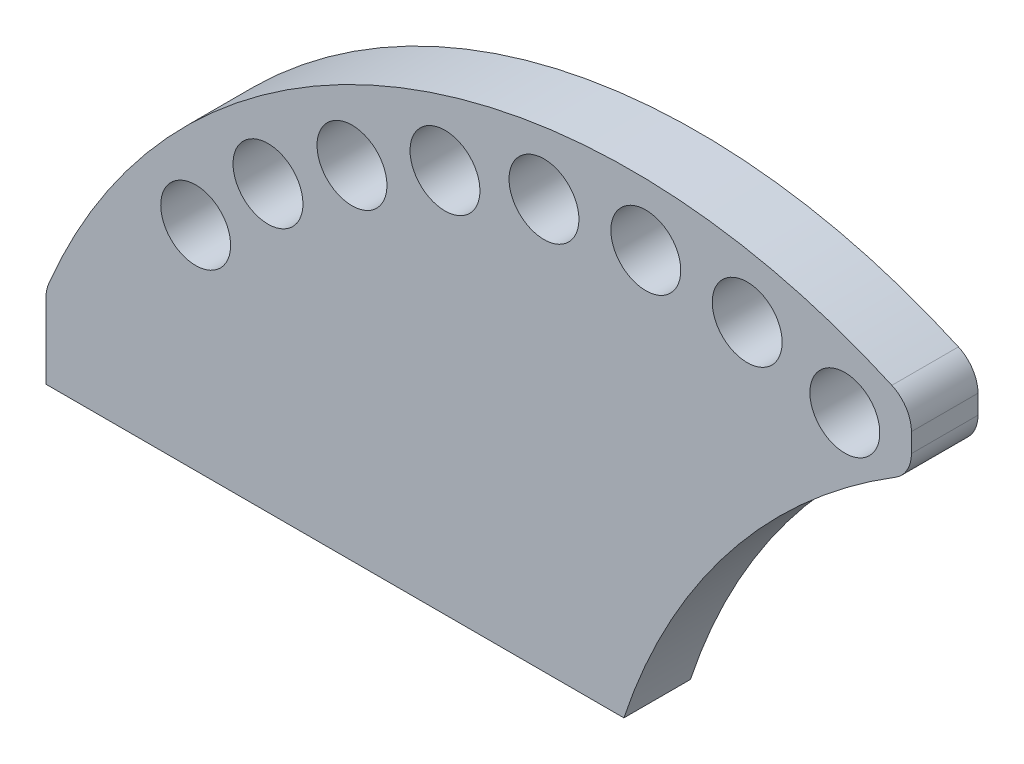
ISO-10303-21;
HEADER;
FILE_DESCRIPTION(('STEP AP214'),'2;1');
FILE_NAME('part.step','',(''),(''),'','','');
FILE_SCHEMA(('AUTOMOTIVE_DESIGN { 1 0 10303 214 1 1 1 1 }'));
ENDSEC;
DATA;
#1=APPLICATION_CONTEXT('core data for automotive mechanical design processes');
#2=APPLICATION_PROTOCOL_DEFINITION('international standard','automotive_design',2000,#1);
#3=PRODUCT_CONTEXT('',#1,'mechanical');
#4=PRODUCT('Part','Part','',(#3));
#5=PRODUCT_RELATED_PRODUCT_CATEGORY('part','',(#4));
#6=PRODUCT_DEFINITION_FORMATION('','',#4);
#7=PRODUCT_DEFINITION_CONTEXT('part definition',#1,'design');
#8=PRODUCT_DEFINITION('design','',#6,#7);
#9=PRODUCT_DEFINITION_SHAPE('','',#8);
#10=(LENGTH_UNIT() NAMED_UNIT(*) SI_UNIT(.MILLI.,.METRE.));
#11=(NAMED_UNIT(*) PLANE_ANGLE_UNIT() SI_UNIT($,.RADIAN.));
#12=(NAMED_UNIT(*) SI_UNIT($,.STERADIAN.) SOLID_ANGLE_UNIT());
#13=UNCERTAINTY_MEASURE_WITH_UNIT(LENGTH_MEASURE(1.E-05),#10,'distance_accuracy_value','');
#14=(GEOMETRIC_REPRESENTATION_CONTEXT(3) GLOBAL_UNCERTAINTY_ASSIGNED_CONTEXT((#13)) GLOBAL_UNIT_ASSIGNED_CONTEXT((#10,
#11,#12)) REPRESENTATION_CONTEXT('',''));
#15=CARTESIAN_POINT('',(0.,0.,0.));
#16=DIRECTION('',(0.,0.,1.));
#17=DIRECTION('',(1.,0.,0.));
#18=AXIS2_PLACEMENT_3D('',#15,#16,#17);
#19=CARTESIAN_POINT('',(-63.,0.,10.));
#20=DIRECTION('',(1.,0.,0.));
#21=DIRECTION('',(0.,1.,0.));
#22=AXIS2_PLACEMENT_3D('',#19,#20,#21);
#23=PLANE('',#22);
#24=DIRECTION('',(0.,-1.,0.));
#25=VECTOR('',#24,1.);
#26=CARTESIAN_POINT('',(-63.,0.,10.));
#27=LINE('',#26,#25);
#28=CARTESIAN_POINT('',(-63.,11.3059270405027,10.));
#29=VERTEX_POINT('',#28);
#30=CARTESIAN_POINT('',(-63.,0.,10.));
#31=VERTEX_POINT('',#30);
#32=EDGE_CURVE('E123',#29,#31,#27,.T.);
#33=ORIENTED_EDGE('',*,*,#32,.F.);
#34=DIRECTION('',(0.,0.,-1.));
#35=VECTOR('',#34,1.);
#36=CARTESIAN_POINT('',(-63.,11.3059270405027,10.));
#37=LINE('',#36,#35);
#38=CARTESIAN_POINT('',(-63.,11.3059270405027,0.));
#39=VERTEX_POINT('',#38);
#40=EDGE_CURVE('E143',#29,#39,#37,.T.);
#41=ORIENTED_EDGE('',*,*,#40,.T.);
#42=DIRECTION('',(0.,-1.,0.));
#43=VECTOR('',#42,1.);
#44=CARTESIAN_POINT('',(-63.,0.,0.));
#45=LINE('',#44,#43);
#46=CARTESIAN_POINT('',(-63.,0.,0.));
#47=VERTEX_POINT('',#46);
#48=EDGE_CURVE('E134',#39,#47,#45,.T.);
#49=ORIENTED_EDGE('',*,*,#48,.T.);
#50=DIRECTION('',(0.,0.,-1.));
#51=VECTOR('',#50,1.);
#52=CARTESIAN_POINT('',(-63.,0.,10.));
#53=LINE('',#52,#51);
#54=EDGE_CURVE('E133',#31,#47,#53,.T.);
#55=ORIENTED_EDGE('',*,*,#54,.F.);
#56=EDGE_LOOP('',(#33,#41,#49,#55));
#57=FACE_BOUND('',#56,.T.);
#58=ADVANCED_FACE('F34',(#57),#23,.F.);
#59=CARTESIAN_POINT('',(-63.,0.,10.));
#60=DIRECTION('',(0.,1.,0.));
#61=DIRECTION('',(0.,0.,1.));
#62=AXIS2_PLACEMENT_3D('',#59,#60,#61);
#63=PLANE('',#62);
#64=DIRECTION('',(1.,0.,0.));
#65=VECTOR('',#64,1.);
#66=CARTESIAN_POINT('',(-63.,0.,0.));
#67=LINE('',#66,#65);
#68=CARTESIAN_POINT('',(23.807895078576,0.,0.));
#69=VERTEX_POINT('',#68);
#70=EDGE_CURVE('E116',#47,#69,#67,.T.);
#71=ORIENTED_EDGE('',*,*,#70,.T.);
#72=DIRECTION('',(0.,0.,-1.));
#73=VECTOR('',#72,1.);
#74=CARTESIAN_POINT('',(23.807895078576,0.,10.));
#75=LINE('',#74,#73);
#76=CARTESIAN_POINT('',(23.807895078576,0.,10.));
#77=VERTEX_POINT('',#76);
#78=EDGE_CURVE('E102',#69,#77,#75,.F.);
#79=ORIENTED_EDGE('',*,*,#78,.T.);
#80=DIRECTION('',(1.,0.,0.));
#81=VECTOR('',#80,1.);
#82=CARTESIAN_POINT('',(-63.,0.,10.));
#83=LINE('',#82,#81);
#84=EDGE_CURVE('E113',#31,#77,#83,.T.);
#85=ORIENTED_EDGE('',*,*,#84,.F.);
#86=ORIENTED_EDGE('',*,*,#54,.T.);
#87=EDGE_LOOP('',(#71,#79,#85,#86));
#88=FACE_BOUND('',#87,.T.);
#89=ADVANCED_FACE('F111',(#88),#63,.F.);
#90=CARTESIAN_POINT('',(67.,0.,10.));
#91=DIRECTION('',(-1.,0.,0.));
#92=DIRECTION('',(0.,0.,1.));
#93=AXIS2_PLACEMENT_3D('',#90,#91,#92);
#94=PLANE('',#93);
#95=DIRECTION('',(0.,1.,0.));
#96=VECTOR('',#95,1.);
#97=CARTESIAN_POINT('',(67.,0.,10.));
#98=LINE('',#97,#96);
#99=CARTESIAN_POINT('',(67.,55.9767410408187,10.));
#100=VERTEX_POINT('',#99);
#101=CARTESIAN_POINT('',(67.,58.8345686742974,10.));
#102=VERTEX_POINT('',#101);
#103=EDGE_CURVE('E124',#100,#102,#98,.T.);
#104=ORIENTED_EDGE('',*,*,#103,.F.);
#105=DIRECTION('',(0.,0.,-1.));
#106=VECTOR('',#105,1.);
#107=CARTESIAN_POINT('',(67.,55.9767410408187,10.));
#108=LINE('',#107,#106);
#109=CARTESIAN_POINT('',(67.,55.9767410408187,0.));
#110=VERTEX_POINT('',#109);
#111=EDGE_CURVE('E42',#100,#110,#108,.T.);
#112=ORIENTED_EDGE('',*,*,#111,.T.);
#113=DIRECTION('',(0.,1.,0.));
#114=VECTOR('',#113,1.);
#115=CARTESIAN_POINT('',(67.,0.,0.));
#116=LINE('',#115,#114);
#117=CARTESIAN_POINT('',(67.,58.8345686742974,0.));
#118=VERTEX_POINT('',#117);
#119=EDGE_CURVE('E138',#110,#118,#116,.T.);
#120=ORIENTED_EDGE('',*,*,#119,.T.);
#121=DIRECTION('',(0.,0.,-1.));
#122=VECTOR('',#121,1.);
#123=CARTESIAN_POINT('',(67.,58.8345686742974,10.));
#124=LINE('',#123,#122);
#125=EDGE_CURVE('E49',#118,#102,#124,.F.);
#126=ORIENTED_EDGE('',*,*,#125,.T.);
#127=EDGE_LOOP('',(#104,#112,#120,#126));
#128=FACE_BOUND('',#127,.T.);
#129=ADVANCED_FACE('F165',(#128),#94,.F.);
#130=CARTESIAN_POINT('',(25.,-23.,10.));
#131=DIRECTION('',(0.,0.,-1.));
#132=DIRECTION('',(-1.,0.,0.));
#133=AXIS2_PLACEMENT_3D('',#130,#131,#132);
#134=CYLINDRICAL_SURFACE('',#133,94.8103369891701);
#135=CARTESIAN_POINT('',(25.,-23.,0.));
#136=DIRECTION('',(0.,0.,1.));
#137=DIRECTION('',(1.,0.,0.));
#138=AXIS2_PLACEMENT_3D('',#135,#136,#137);
#139=CIRCLE('',#138,94.8103369891701);
#140=CARTESIAN_POINT('',(64.0598965130518,63.3905346921159,0.));
#141=VERTEX_POINT('',#140);
#142=CARTESIAN_POINT('',(-62.6208489346838,13.2158367563876,0.));
#143=VERTEX_POINT('',#142);
#144=EDGE_CURVE('E128',#141,#143,#139,.T.);
#145=ORIENTED_EDGE('',*,*,#144,.T.);
#146=DIRECTION('',(0.,0.,-1.));
#147=VECTOR('',#146,1.);
#148=CARTESIAN_POINT('',(-62.6208489346838,13.2158367563876,10.));
#149=LINE('',#148,#147);
#150=CARTESIAN_POINT('',(-62.6208489346838,13.2158367563876,10.));
#151=VERTEX_POINT('',#150);
#152=EDGE_CURVE('E155',#143,#151,#149,.F.);
#153=ORIENTED_EDGE('',*,*,#152,.T.);
#154=CARTESIAN_POINT('',(25.,-23.,10.));
#155=DIRECTION('',(0.,0.,1.));
#156=DIRECTION('',(1.,0.,0.));
#157=AXIS2_PLACEMENT_3D('',#154,#155,#156);
#158=CIRCLE('',#157,94.8103369891701);
#159=CARTESIAN_POINT('',(64.0598965130518,63.3905346921159,10.));
#160=VERTEX_POINT('',#159);
#161=EDGE_CURVE('E126',#160,#151,#158,.T.);
#162=ORIENTED_EDGE('',*,*,#161,.F.);
#163=DIRECTION('',(0.,0.,-1.));
#164=VECTOR('',#163,1.);
#165=CARTESIAN_POINT('',(64.0598965130518,63.3905346921159,10.));
#166=LINE('',#165,#164);
#167=EDGE_CURVE('E152',#160,#141,#166,.T.);
#168=ORIENTED_EDGE('',*,*,#167,.T.);
#169=EDGE_LOOP('',(#145,#153,#162,#168));
#170=FACE_BOUND('',#169,.T.);
#171=ADVANCED_FACE('F176',(#170),#134,.T.);
#172=CARTESIAN_POINT('',(25.,-23.,10.));
#173=DIRECTION('',(0.,0.,1.));
#174=DIRECTION('',(1.,0.,0.));
#175=AXIS2_PLACEMENT_3D('',#172,#173,#174);
#176=PLANE('',#175);
#177=ORIENTED_EDGE('',*,*,#161,.T.);
#178=CARTESIAN_POINT('',(-58.,11.3059270405027,10.));
#179=DIRECTION('',(0.,0.,1.));
#180=DIRECTION('',(1.,0.,0.));
#181=AXIS2_PLACEMENT_3D('',#178,#179,#180);
#182=CIRCLE('',#181,5.);
#183=EDGE_CURVE('E160',#151,#29,#182,.T.);
#184=ORIENTED_EDGE('',*,*,#183,.T.);
#185=ORIENTED_EDGE('',*,*,#32,.T.);
#186=ORIENTED_EDGE('',*,*,#84,.T.);
#187=CARTESIAN_POINT('',(115.,-30.,10.));
#188=DIRECTION('',(0.,0.,-1.));
#189=DIRECTION('',(-1.,0.,0.));
#190=AXIS2_PLACEMENT_3D('',#187,#188,#189);
#191=CIRCLE('',#190,96.);
#192=CARTESIAN_POINT('',(64.6237623762376,51.7204667318673,10.));
#193=VERTEX_POINT('',#192);
#194=EDGE_CURVE('E98',#77,#193,#191,.T.);
#195=ORIENTED_EDGE('',*,*,#194,.T.);
#196=CARTESIAN_POINT('',(62.,55.9767410408187,10.));
#197=DIRECTION('',(0.,0.,1.));
#198=DIRECTION('',(1.,0.,0.));
#199=AXIS2_PLACEMENT_3D('',#196,#197,#198);
#200=CIRCLE('',#199,5.);
#201=EDGE_CURVE('E56',#193,#100,#200,.T.);
#202=ORIENTED_EDGE('',*,*,#201,.T.);
#203=ORIENTED_EDGE('',*,*,#103,.T.);
#204=CARTESIAN_POINT('',(62.,58.8345686742974,10.));
#205=DIRECTION('',(0.,0.,1.));
#206=DIRECTION('',(1.,0.,0.));
#207=AXIS2_PLACEMENT_3D('',#204,#205,#206);
#208=CIRCLE('',#207,5.);
#209=EDGE_CURVE('E157',#102,#160,#208,.T.);
#210=ORIENTED_EDGE('',*,*,#209,.T.);
#211=EDGE_LOOP('',(#177,#184,#185,#186,#195,#202,#203,#210));
#212=FACE_BOUND('',#211,.T.);
#213=CARTESIAN_POINT('',(42.328707165067,60.7255391621181,10.));
#214=DIRECTION('',(0.,0.,-1.));
#215=DIRECTION('',(-0.98392958859863,-0.178556894798637,0.));
#216=AXIS2_PLACEMENT_3D('',#213,#214,#215);
#217=CIRCLE('',#216,5.25);
#218=CARTESIAN_POINT('',(37.1630768249242,59.7881154644252,10.));
#219=VERTEX_POINT('',#218);
#220=EDGE_CURVE('E185',#219,#219,#217,.T.);
#221=ORIENTED_EDGE('',*,*,#220,.T.);
#222=EDGE_LOOP('',(#221));
#223=FACE_BOUND('',#222,.T.);
#224=CARTESIAN_POINT('',(27.100455423741,62.4741954452505,10.));
#225=DIRECTION('',(0.,0.,-1.));
#226=DIRECTION('',(-0.936234870639737,-0.351374824081343,0.));
#227=AXIS2_PLACEMENT_3D('',#224,#225,#226);
#228=CIRCLE('',#227,5.25);
#229=CARTESIAN_POINT('',(22.1852223528824,60.6294776188235,10.));
#230=VERTEX_POINT('',#229);
#231=EDGE_CURVE('E192',#230,#230,#228,.T.);
#232=ORIENTED_EDGE('',*,*,#231,.T.);
#233=EDGE_LOOP('',(#232));
#234=FACE_BOUND('',#233,.T.);
#235=CARTESIAN_POINT('',(11.8046933168355,61.4756407583704,10.));
#236=DIRECTION('',(0.,0.,-1.));
#237=DIRECTION('',(-0.858448793601866,-0.512899277405907,0.));
#238=AXIS2_PLACEMENT_3D('',#235,#236,#237);
#239=CIRCLE('',#238,5.25);
#240=CARTESIAN_POINT('',(7.29783715042574,58.7829195519893,10.));
#241=VERTEX_POINT('',#240);
#242=EDGE_CURVE('E198',#241,#241,#239,.T.);
#243=ORIENTED_EDGE('',*,*,#242,.T.);
#244=EDGE_LOOP('',(#243));
#245=FACE_BOUND('',#244,.T.);
#246=CARTESIAN_POINT('',(-3.06696077613856,57.7619694707274,10.));
#247=DIRECTION('',(0.,0.,-1.));
#248=DIRECTION('',(-0.75307146600361,-0.657938725939714,0.));
#249=AXIS2_PLACEMENT_3D('',#246,#247,#248);
#250=CIRCLE('',#249,5.25);
#251=CARTESIAN_POINT('',(-7.02058597265751,54.3077911595439,10.));
#252=VERTEX_POINT('',#251);
#253=EDGE_CURVE('E204',#252,#252,#250,.T.);
#254=ORIENTED_EDGE('',*,*,#253,.T.);
#255=EDGE_LOOP('',(#254));
#256=FACE_BOUND('',#255,.T.);
#257=CARTESIAN_POINT('',(-17.0365196561953,51.4525420331255,10.));
#258=DIRECTION('',(0.,0.,-1.));
#259=DIRECTION('',(-0.623489801858732,-0.781831482468031,0.));
#260=AXIS2_PLACEMENT_3D('',#257,#258,#259);
#261=CIRCLE('',#260,5.25);
#262=CARTESIAN_POINT('',(-20.3098411159536,47.3479267501683,10.));
#263=VERTEX_POINT('',#262);
#264=EDGE_CURVE('E210',#263,#263,#261,.T.);
#265=ORIENTED_EDGE('',*,*,#264,.T.);
#266=EDGE_LOOP('',(#265));
#267=FACE_BOUND('',#266,.T.);
#268=CARTESIAN_POINT('',(-29.6549902067383,42.7501486348232,10.));
#269=DIRECTION('',(0.,0.,-1.));
#270=DIRECTION('',(-0.473868662472997,-0.880595531856739,0.));
#271=AXIS2_PLACEMENT_3D('',#268,#269,#270);
#272=CIRCLE('',#271,5.25);
#273=CARTESIAN_POINT('',(-32.1428006847215,38.1270220925753,10.));
#274=VERTEX_POINT('',#273);
#275=EDGE_CURVE('E216',#274,#274,#272,.T.);
#276=ORIENTED_EDGE('',*,*,#275,.T.);
#277=EDGE_LOOP('',(#276));
#278=FACE_BOUND('',#277,.T.);
#279=CARTESIAN_POINT('',(-40.5168044017611,31.9344913599953,10.));
#280=DIRECTION('',(0.,0.,-1.));
#281=DIRECTION('',(-0.309016994374945,-0.951056516295155,0.));
#282=AXIS2_PLACEMENT_3D('',#279,#280,#281);
#283=CIRCLE('',#282,5.25);
#284=CARTESIAN_POINT('',(-42.1391436222295,26.9414446494457,10.));
#285=VERTEX_POINT('',#284);
#286=EDGE_CURVE('E222',#285,#285,#283,.T.);
#287=ORIENTED_EDGE('',*,*,#286,.T.);
#288=EDGE_LOOP('',(#287));
#289=FACE_BOUND('',#288,.T.);
#290=CARTESIAN_POINT('',(57.,56.285875160712,10.));
#291=DIRECTION('',(0.,0.,-1.));
#292=DIRECTION('',(-1.,0.,0.));
#293=AXIS2_PLACEMENT_3D('',#290,#291,#292);
#294=CIRCLE('',#293,5.25);
#295=CARTESIAN_POINT('',(51.75,56.285875160712,10.));
#296=VERTEX_POINT('',#295);
#297=EDGE_CURVE('E136',#296,#296,#294,.T.);
#298=ORIENTED_EDGE('',*,*,#297,.T.);
#299=EDGE_LOOP('',(#298));
#300=FACE_BOUND('',#299,.T.);
#301=ADVANCED_FACE('F120',(#212,#223,#234,#245,#256,#267,#278,#289,#300),#176,.T.);
#302=CARTESIAN_POINT('',(25.,-23.,0.));
#303=DIRECTION('',(0.,0.,1.));
#304=DIRECTION('',(1.,0.,0.));
#305=AXIS2_PLACEMENT_3D('',#302,#303,#304);
#306=PLANE('',#305);
#307=CARTESIAN_POINT('',(42.328707165067,60.7255391621181,0.));
#308=DIRECTION('',(0.,0.,-1.));
#309=DIRECTION('',(-0.98392958859863,-0.178556894798637,0.));
#310=AXIS2_PLACEMENT_3D('',#307,#308,#309);
#311=CIRCLE('',#310,5.25);
#312=CARTESIAN_POINT('',(37.1630768249242,59.7881154644252,0.));
#313=VERTEX_POINT('',#312);
#314=EDGE_CURVE('E189',#313,#313,#311,.T.);
#315=ORIENTED_EDGE('',*,*,#314,.F.);
#316=EDGE_LOOP('',(#315));
#317=FACE_BOUND('',#316,.T.);
#318=CARTESIAN_POINT('',(27.100455423741,62.4741954452505,0.));
#319=DIRECTION('',(0.,0.,-1.));
#320=DIRECTION('',(-0.936234870639737,-0.351374824081343,0.));
#321=AXIS2_PLACEMENT_3D('',#318,#319,#320);
#322=CIRCLE('',#321,5.25);
#323=CARTESIAN_POINT('',(22.1852223528824,60.6294776188235,0.));
#324=VERTEX_POINT('',#323);
#325=EDGE_CURVE('E195',#324,#324,#322,.T.);
#326=ORIENTED_EDGE('',*,*,#325,.F.);
#327=EDGE_LOOP('',(#326));
#328=FACE_BOUND('',#327,.T.);
#329=CARTESIAN_POINT('',(11.8046933168355,61.4756407583704,0.));
#330=DIRECTION('',(0.,0.,-1.));
#331=DIRECTION('',(-0.858448793601866,-0.512899277405907,0.));
#332=AXIS2_PLACEMENT_3D('',#329,#330,#331);
#333=CIRCLE('',#332,5.25);
#334=CARTESIAN_POINT('',(7.29783715042574,58.7829195519893,0.));
#335=VERTEX_POINT('',#334);
#336=EDGE_CURVE('E201',#335,#335,#333,.T.);
#337=ORIENTED_EDGE('',*,*,#336,.F.);
#338=EDGE_LOOP('',(#337));
#339=FACE_BOUND('',#338,.T.);
#340=CARTESIAN_POINT('',(-3.06696077613856,57.7619694707274,0.));
#341=DIRECTION('',(0.,0.,-1.));
#342=DIRECTION('',(-0.75307146600361,-0.657938725939714,0.));
#343=AXIS2_PLACEMENT_3D('',#340,#341,#342);
#344=CIRCLE('',#343,5.25);
#345=CARTESIAN_POINT('',(-7.02058597265751,54.3077911595439,0.));
#346=VERTEX_POINT('',#345);
#347=EDGE_CURVE('E207',#346,#346,#344,.T.);
#348=ORIENTED_EDGE('',*,*,#347,.F.);
#349=EDGE_LOOP('',(#348));
#350=FACE_BOUND('',#349,.T.);
#351=CARTESIAN_POINT('',(-17.0365196561953,51.4525420331255,0.));
#352=DIRECTION('',(0.,0.,-1.));
#353=DIRECTION('',(-0.623489801858732,-0.781831482468031,0.));
#354=AXIS2_PLACEMENT_3D('',#351,#352,#353);
#355=CIRCLE('',#354,5.25);
#356=CARTESIAN_POINT('',(-20.3098411159536,47.3479267501683,0.));
#357=VERTEX_POINT('',#356);
#358=EDGE_CURVE('E213',#357,#357,#355,.T.);
#359=ORIENTED_EDGE('',*,*,#358,.F.);
#360=EDGE_LOOP('',(#359));
#361=FACE_BOUND('',#360,.T.);
#362=CARTESIAN_POINT('',(-29.6549902067383,42.7501486348232,0.));
#363=DIRECTION('',(0.,0.,-1.));
#364=DIRECTION('',(-0.473868662472997,-0.880595531856739,0.));
#365=AXIS2_PLACEMENT_3D('',#362,#363,#364);
#366=CIRCLE('',#365,5.25);
#367=CARTESIAN_POINT('',(-32.1428006847215,38.1270220925753,0.));
#368=VERTEX_POINT('',#367);
#369=EDGE_CURVE('E219',#368,#368,#366,.T.);
#370=ORIENTED_EDGE('',*,*,#369,.F.);
#371=EDGE_LOOP('',(#370));
#372=FACE_BOUND('',#371,.T.);
#373=CARTESIAN_POINT('',(-40.5168044017611,31.9344913599953,0.));
#374=DIRECTION('',(0.,0.,-1.));
#375=DIRECTION('',(-0.309016994374945,-0.951056516295155,0.));
#376=AXIS2_PLACEMENT_3D('',#373,#374,#375);
#377=CIRCLE('',#376,5.25);
#378=CARTESIAN_POINT('',(-42.1391436222295,26.9414446494457,0.));
#379=VERTEX_POINT('',#378);
#380=EDGE_CURVE('E117',#379,#379,#377,.T.);
#381=ORIENTED_EDGE('',*,*,#380,.F.);
#382=EDGE_LOOP('',(#381));
#383=FACE_BOUND('',#382,.T.);
#384=CARTESIAN_POINT('',(57.,56.285875160712,0.));
#385=DIRECTION('',(0.,0.,-1.));
#386=DIRECTION('',(-1.,0.,0.));
#387=AXIS2_PLACEMENT_3D('',#384,#385,#386);
#388=CIRCLE('',#387,5.25);
#389=CARTESIAN_POINT('',(51.75,56.285875160712,0.));
#390=VERTEX_POINT('',#389);
#391=EDGE_CURVE('E188',#390,#390,#388,.T.);
#392=ORIENTED_EDGE('',*,*,#391,.F.);
#393=EDGE_LOOP('',(#392));
#394=FACE_BOUND('',#393,.T.);
#395=ORIENTED_EDGE('',*,*,#48,.F.);
#396=CARTESIAN_POINT('',(-58.,11.3059270405027,0.));
#397=DIRECTION('',(0.,0.,1.));
#398=DIRECTION('',(1.,0.,0.));
#399=AXIS2_PLACEMENT_3D('',#396,#397,#398);
#400=CIRCLE('',#399,5.);
#401=EDGE_CURVE('E150',#39,#143,#400,.F.);
#402=ORIENTED_EDGE('',*,*,#401,.T.);
#403=ORIENTED_EDGE('',*,*,#144,.F.);
#404=CARTESIAN_POINT('',(62.,58.8345686742974,0.));
#405=DIRECTION('',(0.,0.,1.));
#406=DIRECTION('',(1.,0.,0.));
#407=AXIS2_PLACEMENT_3D('',#404,#405,#406);
#408=CIRCLE('',#407,5.);
#409=EDGE_CURVE('E146',#141,#118,#408,.F.);
#410=ORIENTED_EDGE('',*,*,#409,.T.);
#411=ORIENTED_EDGE('',*,*,#119,.F.);
#412=CARTESIAN_POINT('',(62.,55.9767410408187,0.));
#413=DIRECTION('',(0.,0.,1.));
#414=DIRECTION('',(1.,0.,0.));
#415=AXIS2_PLACEMENT_3D('',#412,#413,#414);
#416=CIRCLE('',#415,5.);
#417=CARTESIAN_POINT('',(64.6237623762376,51.7204667318673,0.));
#418=VERTEX_POINT('',#417);
#419=EDGE_CURVE('E148',#110,#418,#416,.F.);
#420=ORIENTED_EDGE('',*,*,#419,.T.);
#421=CARTESIAN_POINT('',(115.,-30.,0.));
#422=DIRECTION('',(0.,0.,-1.));
#423=DIRECTION('',(-1.,0.,0.));
#424=AXIS2_PLACEMENT_3D('',#421,#422,#423);
#425=CIRCLE('',#424,96.);
#426=EDGE_CURVE('E106',#69,#418,#425,.T.);
#427=ORIENTED_EDGE('',*,*,#426,.F.);
#428=ORIENTED_EDGE('',*,*,#70,.F.);
#429=EDGE_LOOP('',(#395,#402,#403,#410,#411,#420,#427,#428));
#430=FACE_BOUND('',#429,.T.);
#431=ADVANCED_FACE('F169',(#317,#328,#339,#350,#361,#372,#383,#394,#430),#306,.F.);
#432=CARTESIAN_POINT('',(57.,56.285875160712,10.));
#433=DIRECTION('',(0.,0.,-1.));
#434=DIRECTION('',(-1.,0.,0.));
#435=AXIS2_PLACEMENT_3D('',#432,#433,#434);
#436=CYLINDRICAL_SURFACE('',#435,5.25);
#437=ORIENTED_EDGE('',*,*,#297,.F.);
#438=EDGE_LOOP('',(#437));
#439=FACE_BOUND('',#438,.T.);
#440=ORIENTED_EDGE('',*,*,#391,.T.);
#441=EDGE_LOOP('',(#440));
#442=FACE_BOUND('',#441,.T.);
#443=ADVANCED_FACE('F231',(#439,#442),#436,.F.);
#444=CARTESIAN_POINT('',(-40.5168044017611,31.9344913599953,10.));
#445=DIRECTION('',(0.,0.,-1.));
#446=DIRECTION('',(-1.,0.,0.));
#447=AXIS2_PLACEMENT_3D('',#444,#445,#446);
#448=CYLINDRICAL_SURFACE('',#447,5.25);
#449=ORIENTED_EDGE('',*,*,#286,.F.);
#450=EDGE_LOOP('',(#449));
#451=FACE_BOUND('',#450,.T.);
#452=ORIENTED_EDGE('',*,*,#380,.T.);
#453=EDGE_LOOP('',(#452));
#454=FACE_BOUND('',#453,.T.);
#455=ADVANCED_FACE('F240',(#451,#454),#448,.F.);
#456=CARTESIAN_POINT('',(-29.6549902067383,42.7501486348232,10.));
#457=DIRECTION('',(0.,0.,-1.));
#458=DIRECTION('',(-1.,0.,0.));
#459=AXIS2_PLACEMENT_3D('',#456,#457,#458);
#460=CYLINDRICAL_SURFACE('',#459,5.25);
#461=ORIENTED_EDGE('',*,*,#275,.F.);
#462=EDGE_LOOP('',(#461));
#463=FACE_BOUND('',#462,.T.);
#464=ORIENTED_EDGE('',*,*,#369,.T.);
#465=EDGE_LOOP('',(#464));
#466=FACE_BOUND('',#465,.T.);
#467=ADVANCED_FACE('F333',(#463,#466),#460,.F.);
#468=CARTESIAN_POINT('',(-17.0365196561953,51.4525420331255,10.));
#469=DIRECTION('',(0.,0.,-1.));
#470=DIRECTION('',(-1.,0.,0.));
#471=AXIS2_PLACEMENT_3D('',#468,#469,#470);
#472=CYLINDRICAL_SURFACE('',#471,5.25);
#473=ORIENTED_EDGE('',*,*,#264,.F.);
#474=EDGE_LOOP('',(#473));
#475=FACE_BOUND('',#474,.T.);
#476=ORIENTED_EDGE('',*,*,#358,.T.);
#477=EDGE_LOOP('',(#476));
#478=FACE_BOUND('',#477,.T.);
#479=ADVANCED_FACE('F323',(#475,#478),#472,.F.);
#480=CARTESIAN_POINT('',(-3.06696077613856,57.7619694707274,10.));
#481=DIRECTION('',(0.,0.,-1.));
#482=DIRECTION('',(-1.,0.,0.));
#483=AXIS2_PLACEMENT_3D('',#480,#481,#482);
#484=CYLINDRICAL_SURFACE('',#483,5.25);
#485=ORIENTED_EDGE('',*,*,#253,.F.);
#486=EDGE_LOOP('',(#485));
#487=FACE_BOUND('',#486,.T.);
#488=ORIENTED_EDGE('',*,*,#347,.T.);
#489=EDGE_LOOP('',(#488));
#490=FACE_BOUND('',#489,.T.);
#491=ADVANCED_FACE('F313',(#487,#490),#484,.F.);
#492=CARTESIAN_POINT('',(11.8046933168355,61.4756407583704,10.));
#493=DIRECTION('',(0.,0.,-1.));
#494=DIRECTION('',(-1.,0.,0.));
#495=AXIS2_PLACEMENT_3D('',#492,#493,#494);
#496=CYLINDRICAL_SURFACE('',#495,5.25);
#497=ORIENTED_EDGE('',*,*,#242,.F.);
#498=EDGE_LOOP('',(#497));
#499=FACE_BOUND('',#498,.T.);
#500=ORIENTED_EDGE('',*,*,#336,.T.);
#501=EDGE_LOOP('',(#500));
#502=FACE_BOUND('',#501,.T.);
#503=ADVANCED_FACE('F303',(#499,#502),#496,.F.);
#504=CARTESIAN_POINT('',(27.100455423741,62.4741954452505,10.));
#505=DIRECTION('',(0.,0.,-1.));
#506=DIRECTION('',(-1.,0.,0.));
#507=AXIS2_PLACEMENT_3D('',#504,#505,#506);
#508=CYLINDRICAL_SURFACE('',#507,5.25);
#509=ORIENTED_EDGE('',*,*,#231,.F.);
#510=EDGE_LOOP('',(#509));
#511=FACE_BOUND('',#510,.T.);
#512=ORIENTED_EDGE('',*,*,#325,.T.);
#513=EDGE_LOOP('',(#512));
#514=FACE_BOUND('',#513,.T.);
#515=ADVANCED_FACE('F293',(#511,#514),#508,.F.);
#516=CARTESIAN_POINT('',(42.328707165067,60.7255391621181,10.));
#517=DIRECTION('',(0.,0.,-1.));
#518=DIRECTION('',(-1.,0.,0.));
#519=AXIS2_PLACEMENT_3D('',#516,#517,#518);
#520=CYLINDRICAL_SURFACE('',#519,5.25);
#521=ORIENTED_EDGE('',*,*,#220,.F.);
#522=EDGE_LOOP('',(#521));
#523=FACE_BOUND('',#522,.T.);
#524=ORIENTED_EDGE('',*,*,#314,.T.);
#525=EDGE_LOOP('',(#524));
#526=FACE_BOUND('',#525,.T.);
#527=ADVANCED_FACE('F284',(#523,#526),#520,.F.);
#528=CARTESIAN_POINT('',(115.,-30.,10.));
#529=DIRECTION('',(0.,0.,-1.));
#530=DIRECTION('',(-1.,0.,0.));
#531=AXIS2_PLACEMENT_3D('',#528,#529,#530);
#532=CYLINDRICAL_SURFACE('',#531,96.);
#533=ORIENTED_EDGE('',*,*,#426,.T.);
#534=DIRECTION('',(0.,0.,-1.));
#535=VECTOR('',#534,1.);
#536=CARTESIAN_POINT('',(64.6237623762376,51.7204667318673,10.));
#537=LINE('',#536,#535);
#538=EDGE_CURVE('E11',#418,#193,#537,.F.);
#539=ORIENTED_EDGE('',*,*,#538,.T.);
#540=ORIENTED_EDGE('',*,*,#194,.F.);
#541=ORIENTED_EDGE('',*,*,#78,.F.);
#542=EDGE_LOOP('',(#533,#539,#540,#541));
#543=FACE_BOUND('',#542,.T.);
#544=ADVANCED_FACE('F101',(#543),#532,.F.);
#545=CARTESIAN_POINT('',(-58.,11.3059270405027,10.));
#546=DIRECTION('',(0.,0.,-1.));
#547=DIRECTION('',(-1.,0.,0.));
#548=AXIS2_PLACEMENT_3D('',#545,#546,#547);
#549=CYLINDRICAL_SURFACE('',#548,5.);
#550=ORIENTED_EDGE('',*,*,#183,.F.);
#551=ORIENTED_EDGE('',*,*,#152,.F.);
#552=ORIENTED_EDGE('',*,*,#401,.F.);
#553=ORIENTED_EDGE('',*,*,#40,.F.);
#554=EDGE_LOOP('',(#550,#551,#552,#553));
#555=FACE_BOUND('',#554,.T.);
#556=ADVANCED_FACE('F181',(#555),#549,.T.);
#557=CARTESIAN_POINT('',(62.,55.9767410408187,10.));
#558=DIRECTION('',(0.,0.,-1.));
#559=DIRECTION('',(-1.,0.,0.));
#560=AXIS2_PLACEMENT_3D('',#557,#558,#559);
#561=CYLINDRICAL_SURFACE('',#560,5.);
#562=ORIENTED_EDGE('',*,*,#201,.F.);
#563=ORIENTED_EDGE('',*,*,#538,.F.);
#564=ORIENTED_EDGE('',*,*,#419,.F.);
#565=ORIENTED_EDGE('',*,*,#111,.F.);
#566=EDGE_LOOP('',(#562,#563,#564,#565));
#567=FACE_BOUND('',#566,.T.);
#568=ADVANCED_FACE('F256',(#567),#561,.T.);
#569=CARTESIAN_POINT('',(62.,58.8345686742974,10.));
#570=DIRECTION('',(0.,0.,-1.));
#571=DIRECTION('',(-1.,0.,0.));
#572=AXIS2_PLACEMENT_3D('',#569,#570,#571);
#573=CYLINDRICAL_SURFACE('',#572,5.);
#574=ORIENTED_EDGE('',*,*,#209,.F.);
#575=ORIENTED_EDGE('',*,*,#125,.F.);
#576=ORIENTED_EDGE('',*,*,#409,.F.);
#577=ORIENTED_EDGE('',*,*,#167,.F.);
#578=EDGE_LOOP('',(#574,#575,#576,#577));
#579=FACE_BOUND('',#578,.T.);
#580=ADVANCED_FACE('F36',(#579),#573,.T.);
#581=CLOSED_SHELL('',(#58,#89,#129,#171,#301,#431,#443,#455,#467,#479,#491,#503,#515,#527,#544,
#556,#568,#580));
#582=MANIFOLD_SOLID_BREP('B2',#581);
#583=ADVANCED_BREP_SHAPE_REPRESENTATION('',(#18,#582),#14);
#584=SHAPE_DEFINITION_REPRESENTATION(#9,#583);
ENDSEC;
END-ISO-10303-21;
